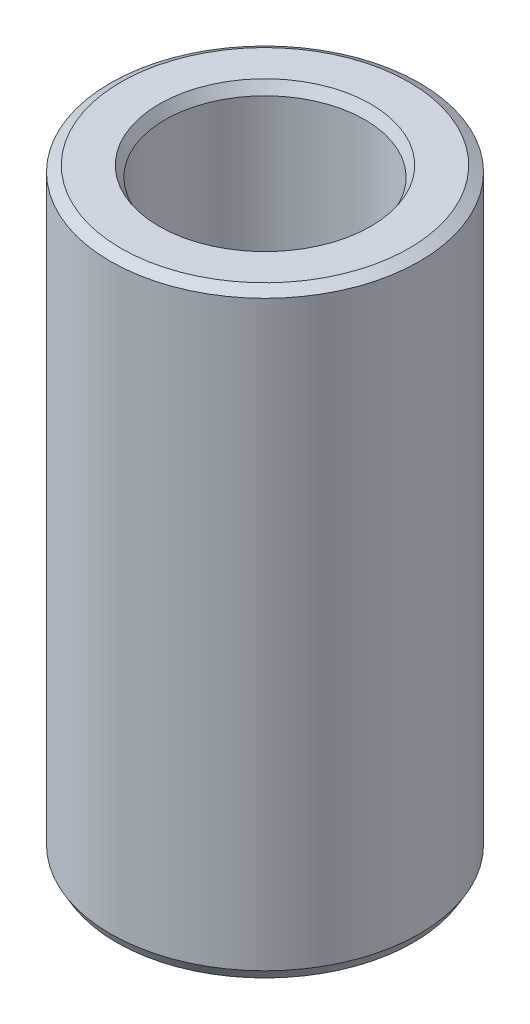
ISO-10303-21;
HEADER;
FILE_DESCRIPTION(('STEP AP214'),'2;1');
FILE_NAME('part.step','',(''),(''),'','','');
FILE_SCHEMA(('AUTOMOTIVE_DESIGN { 1 0 10303 214 1 1 1 1 }'));
ENDSEC;
DATA;
#1=APPLICATION_CONTEXT('core data for automotive mechanical design processes');
#2=APPLICATION_PROTOCOL_DEFINITION('international standard','automotive_design',2000,#1);
#3=PRODUCT_CONTEXT('',#1,'mechanical');
#4=PRODUCT('Part','Part','',(#3));
#5=PRODUCT_RELATED_PRODUCT_CATEGORY('part','',(#4));
#6=PRODUCT_DEFINITION_FORMATION('','',#4);
#7=PRODUCT_DEFINITION_CONTEXT('part definition',#1,'design');
#8=PRODUCT_DEFINITION('design','',#6,#7);
#9=PRODUCT_DEFINITION_SHAPE('','',#8);
#10=(LENGTH_UNIT() NAMED_UNIT(*) SI_UNIT(.MILLI.,.METRE.));
#11=(NAMED_UNIT(*) PLANE_ANGLE_UNIT() SI_UNIT($,.RADIAN.));
#12=(NAMED_UNIT(*) SI_UNIT($,.STERADIAN.) SOLID_ANGLE_UNIT());
#13=UNCERTAINTY_MEASURE_WITH_UNIT(LENGTH_MEASURE(1.E-05),#10,'distance_accuracy_value','');
#14=(GEOMETRIC_REPRESENTATION_CONTEXT(3) GLOBAL_UNCERTAINTY_ASSIGNED_CONTEXT((#13)) GLOBAL_UNIT_ASSIGNED_CONTEXT((#10,
#11,#12)) REPRESENTATION_CONTEXT('',''));
#15=CARTESIAN_POINT('',(0.,0.,0.));
#16=DIRECTION('',(0.,0.,1.));
#17=DIRECTION('',(1.,0.,0.));
#18=AXIS2_PLACEMENT_3D('',#15,#16,#17);
#19=CARTESIAN_POINT('',(0.,232.551561141919,0.));
#20=DIRECTION('',(0.,-1.,0.));
#21=DIRECTION('',(0.,0.,-1.));
#22=AXIS2_PLACEMENT_3D('',#19,#20,#21);
#23=CYLINDRICAL_SURFACE('',#22,60.);
#24=CARTESIAN_POINT('',(0.,4.06920449964837,0.));
#25=DIRECTION('',(0.,1.,0.));
#26=DIRECTION('',(0.,0.,1.));
#27=AXIS2_PLACEMENT_3D('',#24,#25,#26);
#28=CIRCLE('',#27,60.);
#29=CARTESIAN_POINT('',(0.,4.06920449964834,-60.));
#30=VERTEX_POINT('',#29);
#31=EDGE_CURVE('E10',#30,#30,#28,.T.);
#32=CARTESIAN_POINT('',(0.,230.20220482866,0.));
#33=DIRECTION('',(0.,1.,0.));
#34=DIRECTION('',(0.,0.,1.));
#35=AXIS2_PLACEMENT_3D('',#32,#33,#34);
#36=CIRCLE('',#35,60.);
#37=CARTESIAN_POINT('',(0.,230.20220482866,-60.));
#38=VERTEX_POINT('',#37);
#39=EDGE_CURVE('E50',#38,#38,#36,.F.);
#40=CARTESIAN_POINT('',(0.,4.06920449964834,-60.));
#41=CARTESIAN_POINT('',(0.,6.42475658640887,-60.));
#42=CARTESIAN_POINT('',(0.,8.78030867316941,-60.));
#43=CARTESIAN_POINT('',(0.,13.4914128466905,-60.));
#44=CARTESIAN_POINT('',(0.,15.846964933451,-60.));
#45=CARTESIAN_POINT('',(0.,20.5580691069721,-60.));
#46=CARTESIAN_POINT('',(0.,22.9136211937326,-60.));
#47=CARTESIAN_POINT('',(0.,27.6247253672537,-60.));
#48=CARTESIAN_POINT('',(0.,29.9802774540143,-60.));
#49=CARTESIAN_POINT('',(0.,34.6913816275353,-60.));
#50=CARTESIAN_POINT('',(0.,37.0469337142959,-60.));
#51=CARTESIAN_POINT('',(0.,41.7580378878169,-60.));
#52=CARTESIAN_POINT('',(0.,44.1135899745775,-60.));
#53=CARTESIAN_POINT('',(0.,48.8246941480986,-60.));
#54=CARTESIAN_POINT('',(0.,51.1802462348591,-60.));
#55=CARTESIAN_POINT('',(0.,55.8913504083802,-60.));
#56=CARTESIAN_POINT('',(0.,58.2469024951407,-60.));
#57=CARTESIAN_POINT('',(0.,62.9580066686618,-60.));
#58=CARTESIAN_POINT('',(0.,65.3135587554223,-60.));
#59=CARTESIAN_POINT('',(0.,70.0246629289434,-60.));
#60=CARTESIAN_POINT('',(0.,72.3802150157039,-60.));
#61=CARTESIAN_POINT('',(0.,77.091319189225,-60.));
#62=CARTESIAN_POINT('',(0.,79.4468712759856,-60.));
#63=CARTESIAN_POINT('',(0.,84.1579754495066,-60.));
#64=CARTESIAN_POINT('',(0.,86.5135275362672,-60.));
#65=CARTESIAN_POINT('',(0.,91.2246317097882,-60.));
#66=CARTESIAN_POINT('',(0.,93.5801837965488,-60.));
#67=CARTESIAN_POINT('',(0.,98.2912879700698,-60.));
#68=CARTESIAN_POINT('',(0.,100.64684005683,-60.));
#69=CARTESIAN_POINT('',(0.,105.357944230351,-60.));
#70=CARTESIAN_POINT('',(0.,107.713496317112,-60.));
#71=CARTESIAN_POINT('',(0.,112.424600490633,-60.));
#72=CARTESIAN_POINT('',(0.,114.780152577394,-60.));
#73=CARTESIAN_POINT('',(0.,119.491256750915,-60.));
#74=CARTESIAN_POINT('',(0.,121.846808837675,-60.));
#75=CARTESIAN_POINT('',(0.,126.557913011196,-60.));
#76=CARTESIAN_POINT('',(0.,128.913465097957,-60.));
#77=CARTESIAN_POINT('',(0.,133.624569271478,-60.));
#78=CARTESIAN_POINT('',(0.,135.980121358238,-60.));
#79=CARTESIAN_POINT('',(0.,140.69122553176,-60.));
#80=CARTESIAN_POINT('',(0.,143.04677761852,-60.));
#81=CARTESIAN_POINT('',(0.,147.757881792041,-60.));
#82=CARTESIAN_POINT('',(0.,150.113433878802,-60.));
#83=CARTESIAN_POINT('',(0.,154.824538052323,-60.));
#84=CARTESIAN_POINT('',(0.,157.180090139083,-60.));
#85=CARTESIAN_POINT('',(0.,161.891194312604,-60.));
#86=CARTESIAN_POINT('',(0.,164.246746399365,-60.));
#87=CARTESIAN_POINT('',(0.,168.957850572886,-60.));
#88=CARTESIAN_POINT('',(0.,171.313402659646,-60.));
#89=CARTESIAN_POINT('',(0.,176.024506833168,-60.));
#90=CARTESIAN_POINT('',(0.,178.380058919928,-60.));
#91=CARTESIAN_POINT('',(0.,183.091163093449,-60.));
#92=CARTESIAN_POINT('',(0.,185.44671518021,-60.));
#93=CARTESIAN_POINT('',(0.,190.157819353731,-60.));
#94=CARTESIAN_POINT('',(0.,192.513371440491,-60.));
#95=CARTESIAN_POINT('',(0.,197.224475614012,-60.));
#96=CARTESIAN_POINT('',(0.,199.580027700773,-60.));
#97=CARTESIAN_POINT('',(0.,204.291131874294,-60.));
#98=CARTESIAN_POINT('',(0.,206.646683961055,-60.));
#99=CARTESIAN_POINT('',(0.,211.357788134576,-60.));
#100=CARTESIAN_POINT('',(0.,213.713340221336,-60.));
#101=CARTESIAN_POINT('',(0.,218.424444394857,-60.));
#102=CARTESIAN_POINT('',(0.,220.779996481618,-60.));
#103=CARTESIAN_POINT('',(0.,225.491100655139,-60.));
#104=CARTESIAN_POINT('',(0.,227.846652741899,-60.));
#105=CARTESIAN_POINT('',(0.,230.20220482866,-60.));
#106=B_SPLINE_CURVE_WITH_KNOTS('',3,(#40,#41,#42,#43,#44,#45,#46,#47,#48,#49,#50,#51,#52,#53,
#54,#55,#56,#57,#58,#59,#60,#61,#62,#63,#64,#65,#66,#67,#68,#69,#70,#71,#72,#73,#74,#75,#76,#77,
#78,#79,#80,#81,#82,#83,#84,#85,#86,#87,#88,#89,#90,#91,#92,#93,#94,#95,#96,#97,#98,#99,#100,
#101,#102,#103,#104,#105),.UNSPECIFIED.,.F.,.F.,(4,2,2,2,2,2,2,2,2,2,2,2,2,2,2,2,2,2,2,2,2,2,2,
2,2,2,2,2,2,2,2,2,4),(0.,7.06665626028161,14.1333125205632,21.1999687808448,28.2666250411265,
35.3332813014081,42.3999375616897,49.4665938219713,56.5332500822529,63.5999063425345,
70.6665626028161,77.7332188630977,84.7998751233794,91.866531383661,98.9331876439426,
105.999843904224,113.066500164506,120.133156424787,127.199812685069,134.266468945351,
141.333125205632,148.399781465914,155.466437726195,162.533093986477,169.599750246759,
176.66640650704,183.733062767322,190.799719027604,197.866375287885,204.933031548167,
211.999687808448,219.06634406873,226.133000329012),.UNSPECIFIED.);
#107=EDGE_CURVE('BSEAM39',#30,#38,#106,.T.);
#108=ORIENTED_EDGE('',*,*,#31,.T.);
#109=ORIENTED_EDGE('',*,*,#39,.T.);
#110=ORIENTED_EDGE('',*,*,#107,.T.);
#111=ORIENTED_EDGE('',*,*,#107,.F.);
#112=EDGE_LOOP('',(#108,#110,#109,#111));
#113=FACE_BOUND('',#112,.T.);
#114=ADVANCED_FACE('F39',(#113),#23,.T.);
#115=CARTESIAN_POINT('',(0.,232.551561141919,0.));
#116=DIRECTION('',(0.,1.,0.));
#117=DIRECTION('',(0.,0.,1.));
#118=AXIS2_PLACEMENT_3D('',#115,#116,#117);
#119=PLANE('',#118);
#120=CARTESIAN_POINT('',(0.,232.551561141919,0.));
#121=DIRECTION('',(0.,1.,0.));
#122=DIRECTION('',(0.,0.,1.));
#123=AXIS2_PLACEMENT_3D('',#120,#121,#122);
#124=CIRCLE('',#123,41.1121530064459);
#125=CARTESIAN_POINT('',(0.,232.551561141919,41.1121530064459));
#126=VERTEX_POINT('',#125);
#127=EDGE_CURVE('E58',#126,#126,#124,.F.);
#128=ORIENTED_EDGE('',*,*,#127,.T.);
#129=EDGE_LOOP('',(#128));
#130=FACE_BOUND('',#129,.T.);
#131=CARTESIAN_POINT('',(0.,232.551561141919,0.));
#132=DIRECTION('',(0.,1.,0.));
#133=DIRECTION('',(0.,0.,1.));
#134=AXIS2_PLACEMENT_3D('',#131,#132,#133);
#135=CIRCLE('',#134,55.9307955003522);
#136=CARTESIAN_POINT('',(0.,232.551561141919,55.9307955003522));
#137=VERTEX_POINT('',#136);
#138=EDGE_CURVE('E61',#137,#137,#135,.T.);
#139=ORIENTED_EDGE('',*,*,#138,.T.);
#140=EDGE_LOOP('',(#139));
#141=FACE_BOUND('',#140,.T.);
#142=ADVANCED_FACE('F88',(#130,#141),#119,.T.);
#143=CARTESIAN_POINT('',(0.,0.,0.));
#144=DIRECTION('',(0.,1.,0.));
#145=DIRECTION('',(0.,0.,1.));
#146=AXIS2_PLACEMENT_3D('',#143,#144,#145);
#147=PLANE('',#146);
#148=CARTESIAN_POINT('',(0.,0.,0.));
#149=DIRECTION('',(0.,1.,0.));
#150=DIRECTION('',(0.,0.,1.));
#151=AXIS2_PLACEMENT_3D('',#148,#149,#150);
#152=CIRCLE('',#151,42.8320011928342);
#153=CARTESIAN_POINT('',(0.,0.,42.8320011928342));
#154=VERTEX_POINT('',#153);
#155=EDGE_CURVE('E51',#154,#154,#152,.T.);
#156=ORIENTED_EDGE('',*,*,#155,.T.);
#157=EDGE_LOOP('',(#156));
#158=FACE_BOUND('',#157,.T.);
#159=CARTESIAN_POINT('',(0.,0.,0.));
#160=DIRECTION('',(0.,1.,0.));
#161=DIRECTION('',(0.,0.,1.));
#162=AXIS2_PLACEMENT_3D('',#159,#160,#161);
#163=CIRCLE('',#162,57.6506436867403);
#164=CARTESIAN_POINT('',(0.,0.,57.6506436867403));
#165=VERTEX_POINT('',#164);
#166=EDGE_CURVE('E54',#165,#165,#163,.F.);
#167=ORIENTED_EDGE('',*,*,#166,.T.);
#168=EDGE_LOOP('',(#167));
#169=FACE_BOUND('',#168,.T.);
#170=ADVANCED_FACE('F83',(#158,#169),#147,.F.);
#171=CARTESIAN_POINT('',(0.,232.551561141919,0.));
#172=DIRECTION('',(0.,-1.,0.));
#173=DIRECTION('',(0.,0.,-1.));
#174=AXIS2_PLACEMENT_3D('',#171,#172,#173);
#175=CYLINDRICAL_SURFACE('',#174,38.7627966931864);
#176=CARTESIAN_POINT('',(0.,228.482356642271,0.));
#177=DIRECTION('',(0.,1.,0.));
#178=DIRECTION('',(0.,0.,1.));
#179=AXIS2_PLACEMENT_3D('',#176,#177,#178);
#180=CIRCLE('',#179,38.7627966931864);
#181=CARTESIAN_POINT('',(0.,228.482356642271,-38.7627966931864));
#182=VERTEX_POINT('',#181);
#183=EDGE_CURVE('E67',#182,#182,#180,.T.);
#184=CARTESIAN_POINT('',(0.,2.3493563132593,0.));
#185=DIRECTION('',(0.,1.,0.));
#186=DIRECTION('',(0.,0.,1.));
#187=AXIS2_PLACEMENT_3D('',#184,#185,#186);
#188=CIRCLE('',#187,38.7627966931864);
#189=CARTESIAN_POINT('',(0.,2.3493563132593,-38.7627966931864));
#190=VERTEX_POINT('',#189);
#191=EDGE_CURVE('E69',#190,#190,#188,.F.);
#192=CARTESIAN_POINT('',(0.,228.482356642271,-38.7627966931864));
#193=CARTESIAN_POINT('',(0.,226.126804555511,-38.7627966931864));
#194=CARTESIAN_POINT('',(0.,223.77125246875,-38.7627966931864));
#195=CARTESIAN_POINT('',(0.,219.060148295229,-38.7627966931864));
#196=CARTESIAN_POINT('',(0.,216.704596208468,-38.7627966931864));
#197=CARTESIAN_POINT('',(0.,211.993492034947,-38.7627966931864));
#198=CARTESIAN_POINT('',(0.,209.637939948187,-38.7627966931864));
#199=CARTESIAN_POINT('',(0.,204.926835774666,-38.7627966931864));
#200=CARTESIAN_POINT('',(0.,202.571283687905,-38.7627966931864));
#201=CARTESIAN_POINT('',(0.,197.860179514384,-38.7627966931864));
#202=CARTESIAN_POINT('',(0.,195.504627427624,-38.7627966931864));
#203=CARTESIAN_POINT('',(0.,190.793523254102,-38.7627966931864));
#204=CARTESIAN_POINT('',(0.,188.437971167342,-38.7627966931864));
#205=CARTESIAN_POINT('',(0.,183.726866993821,-38.7627966931864));
#206=CARTESIAN_POINT('',(0.,181.37131490706,-38.7627966931864));
#207=CARTESIAN_POINT('',(0.,176.660210733539,-38.7627966931864));
#208=CARTESIAN_POINT('',(0.,174.304658646779,-38.7627966931864));
#209=CARTESIAN_POINT('',(0.,169.593554473258,-38.7627966931864));
#210=CARTESIAN_POINT('',(0.,167.238002386497,-38.7627966931864));
#211=CARTESIAN_POINT('',(0.,162.526898212976,-38.7627966931864));
#212=CARTESIAN_POINT('',(0.,160.171346126215,-38.7627966931864));
#213=CARTESIAN_POINT('',(0.,155.460241952694,-38.7627966931864));
#214=CARTESIAN_POINT('',(0.,153.104689865934,-38.7627966931864));
#215=CARTESIAN_POINT('',(0.,148.393585692413,-38.7627966931864));
#216=CARTESIAN_POINT('',(0.,146.038033605652,-38.7627966931864));
#217=CARTESIAN_POINT('',(0.,141.326929432131,-38.7627966931864));
#218=CARTESIAN_POINT('',(0.,138.971377345371,-38.7627966931864));
#219=CARTESIAN_POINT('',(0.,134.26027317185,-38.7627966931864));
#220=CARTESIAN_POINT('',(0.,131.904721085089,-38.7627966931864));
#221=CARTESIAN_POINT('',(0.,127.193616911568,-38.7627966931864));
#222=CARTESIAN_POINT('',(0.,124.838064824807,-38.7627966931864));
#223=CARTESIAN_POINT('',(0.,120.126960651286,-38.7627966931864));
#224=CARTESIAN_POINT('',(0.,117.771408564526,-38.7627966931864));
#225=CARTESIAN_POINT('',(0.,113.060304391005,-38.7627966931864));
#226=CARTESIAN_POINT('',(0.,110.704752304244,-38.7627966931864));
#227=CARTESIAN_POINT('',(0.,105.993648130723,-38.7627966931864));
#228=CARTESIAN_POINT('',(0.,103.638096043963,-38.7627966931864));
#229=CARTESIAN_POINT('',(0.,98.9269918704414,-38.7627966931864));
#230=CARTESIAN_POINT('',(0.,96.5714397836809,-38.7627966931864));
#231=CARTESIAN_POINT('',(0.,91.8603356101598,-38.7627966931864));
#232=CARTESIAN_POINT('',(0.,89.5047835233993,-38.7627966931864));
#233=CARTESIAN_POINT('',(0.,84.7936793498782,-38.7627966931864));
#234=CARTESIAN_POINT('',(0.,82.4381272631177,-38.7627966931864));
#235=CARTESIAN_POINT('',(0.,77.7270230895966,-38.7627966931864));
#236=CARTESIAN_POINT('',(0.,75.371471002836,-38.7627966931864));
#237=CARTESIAN_POINT('',(0.,70.660366829315,-38.7627966931864));
#238=CARTESIAN_POINT('',(0.,68.3048147425544,-38.7627966931864));
#239=CARTESIAN_POINT('',(0.,63.5937105690333,-38.7627966931864));
#240=CARTESIAN_POINT('',(0.,61.2381584822728,-38.7627966931864));
#241=CARTESIAN_POINT('',(0.,56.5270543087517,-38.7627966931864));
#242=CARTESIAN_POINT('',(0.,54.1715022219912,-38.7627966931864));
#243=CARTESIAN_POINT('',(0.,49.4603980484701,-38.7627966931864));
#244=CARTESIAN_POINT('',(0.,47.1048459617096,-38.7627966931864));
#245=CARTESIAN_POINT('',(0.,42.3937417881885,-38.7627966931864));
#246=CARTESIAN_POINT('',(0.,40.0381897014279,-38.7627966931864));
#247=CARTESIAN_POINT('',(0.,35.3270855279069,-38.7627966931864));
#248=CARTESIAN_POINT('',(0.,32.9715334411463,-38.7627966931864));
#249=CARTESIAN_POINT('',(0.,28.2604292676252,-38.7627966931864));
#250=CARTESIAN_POINT('',(0.,25.9048771808647,-38.7627966931864));
#251=CARTESIAN_POINT('',(0.,21.1937730073436,-38.7627966931864));
#252=CARTESIAN_POINT('',(0.,18.8382209205831,-38.7627966931864));
#253=CARTESIAN_POINT('',(0.,14.127116747062,-38.7627966931864));
#254=CARTESIAN_POINT('',(0.,11.7715646603015,-38.7627966931864));
#255=CARTESIAN_POINT('',(0.,7.06046048678038,-38.7627966931864));
#256=CARTESIAN_POINT('',(0.,4.70490840001984,-38.7627966931864));
#257=CARTESIAN_POINT('',(0.,2.3493563132593,-38.7627966931864));
#258=B_SPLINE_CURVE_WITH_KNOTS('',3,(#192,#193,#194,#195,#196,#197,#198,#199,#200,#201,#202,
#203,#204,#205,#206,#207,#208,#209,#210,#211,#212,#213,#214,#215,#216,#217,#218,#219,#220,#221,
#222,#223,#224,#225,#226,#227,#228,#229,#230,#231,#232,#233,#234,#235,#236,#237,#238,#239,#240,
#241,#242,#243,#244,#245,#246,#247,#248,#249,#250,#251,#252,#253,#254,#255,#256,#257),
.UNSPECIFIED.,.F.,.F.,(4,2,2,2,2,2,2,2,2,2,2,2,2,2,2,2,2,2,2,2,2,2,2,2,2,2,2,2,2,2,2,2,4),(0.,
7.06665626028161,14.1333125205632,21.1999687808448,28.2666250411265,35.3332813014081,
42.3999375616897,49.4665938219713,56.5332500822529,63.5999063425345,70.6665626028161,
77.7332188630978,84.7998751233794,91.866531383661,98.9331876439426,105.999843904224,
113.066500164506,120.133156424788,127.199812685069,134.266468945351,141.333125205632,
148.399781465914,155.466437726196,162.533093986477,169.599750246759,176.66640650704,
183.733062767322,190.799719027604,197.866375287885,204.933031548167,211.999687808449,
219.06634406873,226.133000329012),.UNSPECIFIED.);
#259=EDGE_CURVE('BSEAM71',#182,#190,#258,.T.);
#260=ORIENTED_EDGE('',*,*,#183,.T.);
#261=ORIENTED_EDGE('',*,*,#191,.T.);
#262=ORIENTED_EDGE('',*,*,#259,.T.);
#263=ORIENTED_EDGE('',*,*,#259,.F.);
#264=EDGE_LOOP('',(#260,#262,#261,#263));
#265=FACE_BOUND('',#264,.T.);
#266=ADVANCED_FACE('F71',(#265),#175,.F.);
#267=CARTESIAN_POINT('',(0.,228.482356642271,0.));
#268=DIRECTION('',(0.,1.,0.));
#269=DIRECTION('',(0.,0.,1.));
#270=AXIS2_PLACEMENT_3D('',#267,#268,#269);
#271=CONICAL_SURFACE('',#270,38.7627966931864,0.523598775598298);
#272=ORIENTED_EDGE('',*,*,#127,.F.);
#273=EDGE_LOOP('',(#272));
#274=FACE_BOUND('',#273,.T.);
#275=ORIENTED_EDGE('',*,*,#183,.F.);
#276=EDGE_LOOP('',(#275));
#277=FACE_BOUND('',#276,.T.);
#278=ADVANCED_FACE('F77',(#274,#277),#271,.F.);
#279=CARTESIAN_POINT('',(0.,0.,0.));
#280=DIRECTION('',(0.,-1.,0.));
#281=DIRECTION('',(0.,0.,-1.));
#282=AXIS2_PLACEMENT_3D('',#279,#280,#281);
#283=CONICAL_SURFACE('',#282,42.8320011928342,1.04719755119659);
#284=ORIENTED_EDGE('',*,*,#191,.F.);
#285=EDGE_LOOP('',(#284));
#286=FACE_BOUND('',#285,.T.);
#287=ORIENTED_EDGE('',*,*,#155,.F.);
#288=EDGE_LOOP('',(#287));
#289=FACE_BOUND('',#288,.T.);
#290=ADVANCED_FACE('F73',(#286,#289),#283,.F.);
#291=CARTESIAN_POINT('',(0.,4.06920449964837,0.));
#292=DIRECTION('',(0.,1.,0.));
#293=DIRECTION('',(0.,0.,1.));
#294=AXIS2_PLACEMENT_3D('',#291,#292,#293);
#295=CONICAL_SURFACE('',#294,60.,0.523598775598304);
#296=ORIENTED_EDGE('',*,*,#166,.F.);
#297=EDGE_LOOP('',(#296));
#298=FACE_BOUND('',#297,.T.);
#299=ORIENTED_EDGE('',*,*,#31,.F.);
#300=EDGE_LOOP('',(#299));
#301=FACE_BOUND('',#300,.T.);
#302=ADVANCED_FACE('F76',(#298,#301),#295,.T.);
#303=CARTESIAN_POINT('',(0.,232.551561141919,0.));
#304=DIRECTION('',(0.,-1.,0.));
#305=DIRECTION('',(0.,0.,-1.));
#306=AXIS2_PLACEMENT_3D('',#303,#304,#305);
#307=CONICAL_SURFACE('',#306,55.9307955003522,1.0471975511966);
#308=ORIENTED_EDGE('',*,*,#39,.F.);
#309=EDGE_LOOP('',(#308));
#310=FACE_BOUND('',#309,.T.);
#311=ORIENTED_EDGE('',*,*,#138,.F.);
#312=EDGE_LOOP('',(#311));
#313=FACE_BOUND('',#312,.T.);
#314=ADVANCED_FACE('F45',(#310,#313),#307,.T.);
#315=CLOSED_SHELL('',(#114,#142,#170,#266,#278,#290,#302,#314));
#316=MANIFOLD_SOLID_BREP('B2',#315);
#317=ADVANCED_BREP_SHAPE_REPRESENTATION('',(#18,#316),#14);
#318=SHAPE_DEFINITION_REPRESENTATION(#9,#317);
ENDSEC;
END-ISO-10303-21;
